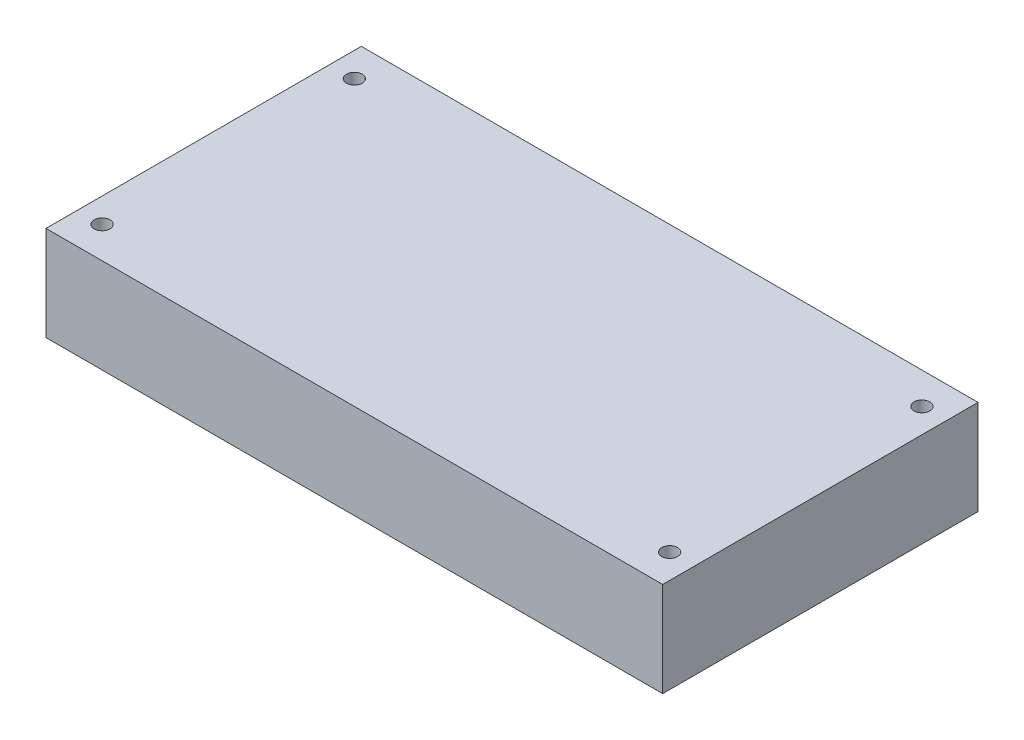
ISO-10303-21;
HEADER;
FILE_DESCRIPTION(('STEP AP214'),'2;1');
FILE_NAME('part.step','',(''),(''),'','','');
FILE_SCHEMA(('AUTOMOTIVE_DESIGN { 1 0 10303 214 1 1 1 1 }'));
ENDSEC;
DATA;
#1=APPLICATION_CONTEXT('core data for automotive mechanical design processes');
#2=APPLICATION_PROTOCOL_DEFINITION('international standard','automotive_design',2000,#1);
#3=PRODUCT_CONTEXT('',#1,'mechanical');
#4=PRODUCT('Part','Part','',(#3));
#5=PRODUCT_RELATED_PRODUCT_CATEGORY('part','',(#4));
#6=PRODUCT_DEFINITION_FORMATION('','',#4);
#7=PRODUCT_DEFINITION_CONTEXT('part definition',#1,'design');
#8=PRODUCT_DEFINITION('design','',#6,#7);
#9=PRODUCT_DEFINITION_SHAPE('','',#8);
#10=(LENGTH_UNIT() NAMED_UNIT(*) SI_UNIT(.MILLI.,.METRE.));
#11=(NAMED_UNIT(*) PLANE_ANGLE_UNIT() SI_UNIT($,.RADIAN.));
#12=(NAMED_UNIT(*) SI_UNIT($,.STERADIAN.) SOLID_ANGLE_UNIT());
#13=UNCERTAINTY_MEASURE_WITH_UNIT(LENGTH_MEASURE(1.E-05),#10,'distance_accuracy_value','');
#14=(GEOMETRIC_REPRESENTATION_CONTEXT(3) GLOBAL_UNCERTAINTY_ASSIGNED_CONTEXT((#13)) GLOBAL_UNIT_ASSIGNED_CONTEXT((#10,
#11,#12)) REPRESENTATION_CONTEXT('',''));
#15=CARTESIAN_POINT('',(0.,0.,0.));
#16=DIRECTION('',(0.,0.,1.));
#17=DIRECTION('',(1.,0.,0.));
#18=AXIS2_PLACEMENT_3D('',#15,#16,#17);
#19=CARTESIAN_POINT('',(0.,15.,0.));
#20=DIRECTION('',(0.,-1.,0.));
#21=DIRECTION('',(0.,0.,-1.));
#22=AXIS2_PLACEMENT_3D('',#19,#20,#21);
#23=PLANE('',#22);
#24=DIRECTION('',(0.,0.,-1.));
#25=VECTOR('',#24,1.);
#26=CARTESIAN_POINT('',(48.895,15.,25.));
#27=LINE('',#26,#25);
#28=CARTESIAN_POINT('',(48.895,15.,25.));
#29=VERTEX_POINT('',#28);
#30=CARTESIAN_POINT('',(48.895,15.,-25.));
#31=VERTEX_POINT('',#30);
#32=EDGE_CURVE('E85',#29,#31,#27,.T.);
#33=ORIENTED_EDGE('',*,*,#32,.T.);
#34=DIRECTION('',(-1.,0.,0.));
#35=VECTOR('',#34,1.);
#36=CARTESIAN_POINT('',(-48.895,15.,-25.));
#37=LINE('',#36,#35);
#38=CARTESIAN_POINT('',(-48.895,15.,-25.));
#39=VERTEX_POINT('',#38);
#40=EDGE_CURVE('E80',#31,#39,#37,.T.);
#41=ORIENTED_EDGE('',*,*,#40,.T.);
#42=DIRECTION('',(0.,0.,1.));
#43=VECTOR('',#42,1.);
#44=CARTESIAN_POINT('',(-48.895,15.,25.));
#45=LINE('',#44,#43);
#46=CARTESIAN_POINT('',(-48.895,15.,25.));
#47=VERTEX_POINT('',#46);
#48=EDGE_CURVE('E83',#39,#47,#45,.T.);
#49=ORIENTED_EDGE('',*,*,#48,.T.);
#50=DIRECTION('',(1.,0.,0.));
#51=VECTOR('',#50,1.);
#52=CARTESIAN_POINT('',(-48.895,15.,25.));
#53=LINE('',#52,#51);
#54=EDGE_CURVE('E50',#47,#29,#53,.T.);
#55=ORIENTED_EDGE('',*,*,#54,.T.);
#56=EDGE_LOOP('',(#33,#41,#49,#55));
#57=FACE_BOUND('',#56,.T.);
#58=CARTESIAN_POINT('',(45.,15.,-20.));
#59=DIRECTION('',(0.,1.,0.));
#60=DIRECTION('',(0.,0.,1.));
#61=AXIS2_PLACEMENT_3D('',#58,#59,#60);
#62=CIRCLE('',#61,1.25);
#63=CARTESIAN_POINT('',(45.,15.,-18.75));
#64=VERTEX_POINT('',#63);
#65=EDGE_CURVE('E100',#64,#64,#62,.T.);
#66=ORIENTED_EDGE('',*,*,#65,.F.);
#67=EDGE_LOOP('',(#66));
#68=FACE_BOUND('',#67,.T.);
#69=CARTESIAN_POINT('',(-45.,15.,-20.));
#70=DIRECTION('',(0.,1.,0.));
#71=DIRECTION('',(0.,0.,1.));
#72=AXIS2_PLACEMENT_3D('',#69,#70,#71);
#73=CIRCLE('',#72,1.25);
#74=CARTESIAN_POINT('',(-45.,15.,-18.75));
#75=VERTEX_POINT('',#74);
#76=EDGE_CURVE('E115',#75,#75,#73,.T.);
#77=ORIENTED_EDGE('',*,*,#76,.F.);
#78=EDGE_LOOP('',(#77));
#79=FACE_BOUND('',#78,.T.);
#80=CARTESIAN_POINT('',(45.,15.,20.));
#81=DIRECTION('',(0.,1.,0.));
#82=DIRECTION('',(0.,0.,-1.));
#83=AXIS2_PLACEMENT_3D('',#80,#81,#82);
#84=CIRCLE('',#83,1.25);
#85=CARTESIAN_POINT('',(45.,15.,18.75));
#86=VERTEX_POINT('',#85);
#87=EDGE_CURVE('E121',#86,#86,#84,.T.);
#88=ORIENTED_EDGE('',*,*,#87,.F.);
#89=EDGE_LOOP('',(#88));
#90=FACE_BOUND('',#89,.T.);
#91=CARTESIAN_POINT('',(-45.,15.,20.));
#92=DIRECTION('',(0.,1.,0.));
#93=DIRECTION('',(0.,0.,-1.));
#94=AXIS2_PLACEMENT_3D('',#91,#92,#93);
#95=CIRCLE('',#94,1.25);
#96=CARTESIAN_POINT('',(-45.,15.,18.75));
#97=VERTEX_POINT('',#96);
#98=EDGE_CURVE('E127',#97,#97,#95,.T.);
#99=ORIENTED_EDGE('',*,*,#98,.F.);
#100=EDGE_LOOP('',(#99));
#101=FACE_BOUND('',#100,.T.);
#102=ADVANCED_FACE('F33',(#57,#68,#79,#90,#101),#23,.F.);
#103=CARTESIAN_POINT('',(0.,0.,0.));
#104=DIRECTION('',(0.,-1.,0.));
#105=DIRECTION('',(0.,0.,-1.));
#106=AXIS2_PLACEMENT_3D('',#103,#104,#105);
#107=PLANE('',#106);
#108=CARTESIAN_POINT('',(45.,0.,20.));
#109=DIRECTION('',(0.,1.,0.));
#110=DIRECTION('',(0.,0.,-1.));
#111=AXIS2_PLACEMENT_3D('',#108,#109,#110);
#112=CIRCLE('',#111,1.25);
#113=CARTESIAN_POINT('',(45.,0.,18.75));
#114=VERTEX_POINT('',#113);
#115=EDGE_CURVE('E124',#114,#114,#112,.T.);
#116=ORIENTED_EDGE('',*,*,#115,.T.);
#117=EDGE_LOOP('',(#116));
#118=FACE_BOUND('',#117,.T.);
#119=CARTESIAN_POINT('',(45.,0.,-20.));
#120=DIRECTION('',(0.,1.,0.));
#121=DIRECTION('',(0.,0.,1.));
#122=AXIS2_PLACEMENT_3D('',#119,#120,#121);
#123=CIRCLE('',#122,1.25);
#124=CARTESIAN_POINT('',(45.,0.,-18.75));
#125=VERTEX_POINT('',#124);
#126=EDGE_CURVE('E112',#125,#125,#123,.T.);
#127=ORIENTED_EDGE('',*,*,#126,.T.);
#128=EDGE_LOOP('',(#127));
#129=FACE_BOUND('',#128,.T.);
#130=DIRECTION('',(0.,0.,-1.));
#131=VECTOR('',#130,1.);
#132=CARTESIAN_POINT('',(48.895,0.,25.));
#133=LINE('',#132,#131);
#134=CARTESIAN_POINT('',(48.895,0.,25.));
#135=VERTEX_POINT('',#134);
#136=CARTESIAN_POINT('',(48.895,0.,-25.));
#137=VERTEX_POINT('',#136);
#138=EDGE_CURVE('E97',#135,#137,#133,.T.);
#139=ORIENTED_EDGE('',*,*,#138,.F.);
#140=DIRECTION('',(1.,0.,0.));
#141=VECTOR('',#140,1.);
#142=CARTESIAN_POINT('',(-48.895,0.,25.));
#143=LINE('',#142,#141);
#144=CARTESIAN_POINT('',(-48.895,0.,25.));
#145=VERTEX_POINT('',#144);
#146=EDGE_CURVE('E73',#145,#135,#143,.T.);
#147=ORIENTED_EDGE('',*,*,#146,.F.);
#148=DIRECTION('',(0.,0.,1.));
#149=VECTOR('',#148,1.);
#150=CARTESIAN_POINT('',(-48.895,0.,25.));
#151=LINE('',#150,#149);
#152=CARTESIAN_POINT('',(-48.895,0.,-25.));
#153=VERTEX_POINT('',#152);
#154=EDGE_CURVE('E67',#153,#145,#151,.T.);
#155=ORIENTED_EDGE('',*,*,#154,.F.);
#156=DIRECTION('',(-1.,0.,0.));
#157=VECTOR('',#156,1.);
#158=CARTESIAN_POINT('',(-48.895,0.,-25.));
#159=LINE('',#158,#157);
#160=EDGE_CURVE('E89',#137,#153,#159,.T.);
#161=ORIENTED_EDGE('',*,*,#160,.F.);
#162=EDGE_LOOP('',(#139,#147,#155,#161));
#163=FACE_BOUND('',#162,.T.);
#164=CARTESIAN_POINT('',(-45.,0.,-20.));
#165=DIRECTION('',(0.,1.,0.));
#166=DIRECTION('',(0.,0.,1.));
#167=AXIS2_PLACEMENT_3D('',#164,#165,#166);
#168=CIRCLE('',#167,1.25);
#169=CARTESIAN_POINT('',(-45.,0.,-18.75));
#170=VERTEX_POINT('',#169);
#171=EDGE_CURVE('E118',#170,#170,#168,.T.);
#172=ORIENTED_EDGE('',*,*,#171,.T.);
#173=EDGE_LOOP('',(#172));
#174=FACE_BOUND('',#173,.T.);
#175=CARTESIAN_POINT('',(-45.,0.,20.));
#176=DIRECTION('',(0.,1.,0.));
#177=DIRECTION('',(0.,0.,-1.));
#178=AXIS2_PLACEMENT_3D('',#175,#176,#177);
#179=CIRCLE('',#178,1.25);
#180=CARTESIAN_POINT('',(-45.,0.,18.75));
#181=VERTEX_POINT('',#180);
#182=EDGE_CURVE('E130',#181,#181,#179,.T.);
#183=ORIENTED_EDGE('',*,*,#182,.T.);
#184=EDGE_LOOP('',(#183));
#185=FACE_BOUND('',#184,.T.);
#186=ADVANCED_FACE('F108',(#118,#129,#163,#174,#185),#107,.T.);
#187=CARTESIAN_POINT('',(48.895,15.,25.));
#188=DIRECTION('',(-1.,0.,0.));
#189=DIRECTION('',(0.,0.,1.));
#190=AXIS2_PLACEMENT_3D('',#187,#188,#189);
#191=PLANE('',#190);
#192=ORIENTED_EDGE('',*,*,#138,.T.);
#193=DIRECTION('',(0.,-1.,0.));
#194=VECTOR('',#193,1.);
#195=CARTESIAN_POINT('',(48.895,15.,-25.));
#196=LINE('',#195,#194);
#197=EDGE_CURVE('E11',#31,#137,#196,.T.);
#198=ORIENTED_EDGE('',*,*,#197,.F.);
#199=ORIENTED_EDGE('',*,*,#32,.F.);
#200=DIRECTION('',(0.,-1.,0.));
#201=VECTOR('',#200,1.);
#202=CARTESIAN_POINT('',(48.895,15.,25.));
#203=LINE('',#202,#201);
#204=EDGE_CURVE('E93',#29,#135,#203,.T.);
#205=ORIENTED_EDGE('',*,*,#204,.T.);
#206=EDGE_LOOP('',(#192,#198,#199,#205));
#207=FACE_BOUND('',#206,.T.);
#208=ADVANCED_FACE('F35',(#207),#191,.F.);
#209=CARTESIAN_POINT('',(-48.895,15.,-25.));
#210=DIRECTION('',(0.,0.,1.));
#211=DIRECTION('',(1.,0.,0.));
#212=AXIS2_PLACEMENT_3D('',#209,#210,#211);
#213=PLANE('',#212);
#214=ORIENTED_EDGE('',*,*,#160,.T.);
#215=DIRECTION('',(0.,-1.,0.));
#216=VECTOR('',#215,1.);
#217=CARTESIAN_POINT('',(-48.895,15.,-25.));
#218=LINE('',#217,#216);
#219=EDGE_CURVE('E42',#39,#153,#218,.T.);
#220=ORIENTED_EDGE('',*,*,#219,.F.);
#221=ORIENTED_EDGE('',*,*,#40,.F.);
#222=ORIENTED_EDGE('',*,*,#197,.T.);
#223=EDGE_LOOP('',(#214,#220,#221,#222));
#224=FACE_BOUND('',#223,.T.);
#225=ADVANCED_FACE('F88',(#224),#213,.F.);
#226=CARTESIAN_POINT('',(-48.895,15.,25.));
#227=DIRECTION('',(1.,0.,0.));
#228=DIRECTION('',(0.,0.,-1.));
#229=AXIS2_PLACEMENT_3D('',#226,#227,#228);
#230=PLANE('',#229);
#231=ORIENTED_EDGE('',*,*,#154,.T.);
#232=DIRECTION('',(0.,-1.,0.));
#233=VECTOR('',#232,1.);
#234=CARTESIAN_POINT('',(-48.895,15.,25.));
#235=LINE('',#234,#233);
#236=EDGE_CURVE('E90',#47,#145,#235,.T.);
#237=ORIENTED_EDGE('',*,*,#236,.F.);
#238=ORIENTED_EDGE('',*,*,#48,.F.);
#239=ORIENTED_EDGE('',*,*,#219,.T.);
#240=EDGE_LOOP('',(#231,#237,#238,#239));
#241=FACE_BOUND('',#240,.T.);
#242=ADVANCED_FACE('F91',(#241),#230,.F.);
#243=CARTESIAN_POINT('',(-48.895,15.,25.));
#244=DIRECTION('',(0.,0.,-1.));
#245=DIRECTION('',(-1.,0.,0.));
#246=AXIS2_PLACEMENT_3D('',#243,#244,#245);
#247=PLANE('',#246);
#248=ORIENTED_EDGE('',*,*,#146,.T.);
#249=ORIENTED_EDGE('',*,*,#204,.F.);
#250=ORIENTED_EDGE('',*,*,#54,.F.);
#251=ORIENTED_EDGE('',*,*,#236,.T.);
#252=EDGE_LOOP('',(#248,#249,#250,#251));
#253=FACE_BOUND('',#252,.T.);
#254=ADVANCED_FACE('F105',(#253),#247,.F.);
#255=CARTESIAN_POINT('',(45.,15.,-20.));
#256=DIRECTION('',(0.,-1.,0.));
#257=DIRECTION('',(0.,0.,-1.));
#258=AXIS2_PLACEMENT_3D('',#255,#256,#257);
#259=CYLINDRICAL_SURFACE('',#258,1.25);
#260=ORIENTED_EDGE('',*,*,#65,.T.);
#261=EDGE_LOOP('',(#260));
#262=FACE_BOUND('',#261,.T.);
#263=ORIENTED_EDGE('',*,*,#126,.F.);
#264=EDGE_LOOP('',(#263));
#265=FACE_BOUND('',#264,.T.);
#266=ADVANCED_FACE('F147',(#262,#265),#259,.F.);
#267=CARTESIAN_POINT('',(-45.,15.,-20.));
#268=DIRECTION('',(0.,-1.,0.));
#269=DIRECTION('',(0.,0.,-1.));
#270=AXIS2_PLACEMENT_3D('',#267,#268,#269);
#271=CYLINDRICAL_SURFACE('',#270,1.25);
#272=ORIENTED_EDGE('',*,*,#76,.T.);
#273=EDGE_LOOP('',(#272));
#274=FACE_BOUND('',#273,.T.);
#275=ORIENTED_EDGE('',*,*,#171,.F.);
#276=EDGE_LOOP('',(#275));
#277=FACE_BOUND('',#276,.T.);
#278=ADVANCED_FACE('F193',(#274,#277),#271,.F.);
#279=CARTESIAN_POINT('',(45.,15.,20.));
#280=DIRECTION('',(0.,-1.,0.));
#281=DIRECTION('',(0.,0.,-1.));
#282=AXIS2_PLACEMENT_3D('',#279,#280,#281);
#283=CYLINDRICAL_SURFACE('',#282,1.25);
#284=ORIENTED_EDGE('',*,*,#87,.T.);
#285=EDGE_LOOP('',(#284));
#286=FACE_BOUND('',#285,.T.);
#287=ORIENTED_EDGE('',*,*,#115,.F.);
#288=EDGE_LOOP('',(#287));
#289=FACE_BOUND('',#288,.T.);
#290=ADVANCED_FACE('F201',(#286,#289),#283,.F.);
#291=CARTESIAN_POINT('',(-45.,15.,20.));
#292=DIRECTION('',(0.,-1.,0.));
#293=DIRECTION('',(0.,0.,-1.));
#294=AXIS2_PLACEMENT_3D('',#291,#292,#293);
#295=CYLINDRICAL_SURFACE('',#294,1.25);
#296=ORIENTED_EDGE('',*,*,#98,.T.);
#297=EDGE_LOOP('',(#296));
#298=FACE_BOUND('',#297,.T.);
#299=ORIENTED_EDGE('',*,*,#182,.F.);
#300=EDGE_LOOP('',(#299));
#301=FACE_BOUND('',#300,.T.);
#302=ADVANCED_FACE('F136',(#298,#301),#295,.F.);
#303=CLOSED_SHELL('',(#102,#186,#208,#225,#242,#254,#266,#278,#290,#302));
#304=MANIFOLD_SOLID_BREP('B2',#303);
#305=ADVANCED_BREP_SHAPE_REPRESENTATION('',(#18,#304),#14);
#306=SHAPE_DEFINITION_REPRESENTATION(#9,#305);
ENDSEC;
END-ISO-10303-21;
